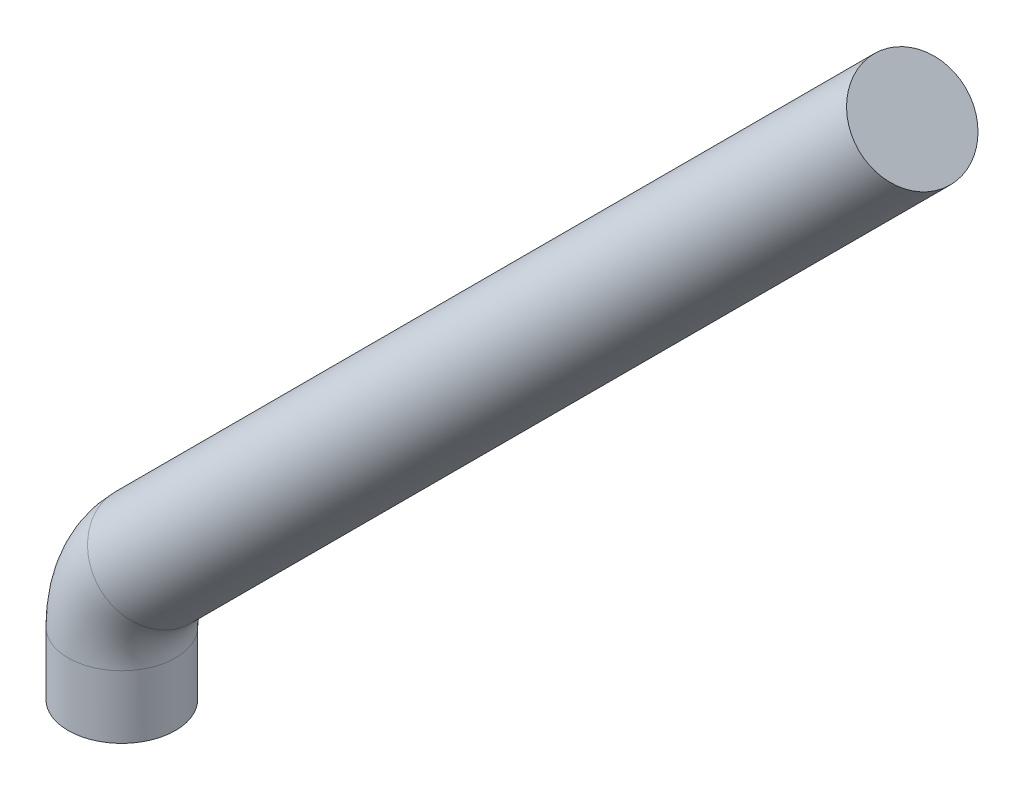
ISO-10303-21;
HEADER;
FILE_DESCRIPTION(('STEP AP214'),'2;1');
FILE_NAME('part.step','',(''),(''),'','','');
FILE_SCHEMA(('AUTOMOTIVE_DESIGN { 1 0 10303 214 1 1 1 1 }'));
ENDSEC;
DATA;
#1=APPLICATION_CONTEXT('core data for automotive mechanical design processes');
#2=APPLICATION_PROTOCOL_DEFINITION('international standard','automotive_design',2000,#1);
#3=PRODUCT_CONTEXT('',#1,'mechanical');
#4=PRODUCT('Part','Part','',(#3));
#5=PRODUCT_RELATED_PRODUCT_CATEGORY('part','',(#4));
#6=PRODUCT_DEFINITION_FORMATION('','',#4);
#7=PRODUCT_DEFINITION_CONTEXT('part definition',#1,'design');
#8=PRODUCT_DEFINITION('design','',#6,#7);
#9=PRODUCT_DEFINITION_SHAPE('','',#8);
#10=(LENGTH_UNIT() NAMED_UNIT(*) SI_UNIT(.MILLI.,.METRE.));
#11=(NAMED_UNIT(*) PLANE_ANGLE_UNIT() SI_UNIT($,.RADIAN.));
#12=(NAMED_UNIT(*) SI_UNIT($,.STERADIAN.) SOLID_ANGLE_UNIT());
#13=UNCERTAINTY_MEASURE_WITH_UNIT(LENGTH_MEASURE(1.E-05),#10,'distance_accuracy_value','');
#14=(GEOMETRIC_REPRESENTATION_CONTEXT(3) GLOBAL_UNCERTAINTY_ASSIGNED_CONTEXT((#13)) GLOBAL_UNIT_ASSIGNED_CONTEXT((#10,
#11,#12)) REPRESENTATION_CONTEXT('',''));
#15=CARTESIAN_POINT('',(0.,0.,0.));
#16=DIRECTION('',(0.,0.,1.));
#17=DIRECTION('',(1.,0.,0.));
#18=AXIS2_PLACEMENT_3D('',#15,#16,#17);
#19=CARTESIAN_POINT('',(0.,0.,0.));
#20=DIRECTION('',(0.,-1.,0.));
#21=DIRECTION('',(1.,0.,0.));
#22=AXIS2_PLACEMENT_3D('',#19,#20,#21);
#23=PLANE('',#22);
#24=CARTESIAN_POINT('',(0.,0.,0.));
#25=DIRECTION('',(0.,-1.,0.));
#26=DIRECTION('',(1.,0.,0.));
#27=AXIS2_PLACEMENT_3D('',#24,#25,#26);
#28=CIRCLE('',#27,0.127);
#29=CARTESIAN_POINT('',(0.127,0.,0.));
#30=VERTEX_POINT('',#29);
#31=EDGE_CURVE('E61',#30,#30,#28,.T.);
#32=ORIENTED_EDGE('',*,*,#31,.T.);
#33=EDGE_LOOP('',(#32));
#34=FACE_BOUND('',#33,.T.);
#35=ADVANCED_FACE('F47',(#34),#23,.T.);
#36=CARTESIAN_POINT('',(1.87044610179245,2.12444610179244,0.));
#37=DIRECTION('',(-0.707106781186549,-0.707106781186546,0.));
#38=DIRECTION('',(0.707106781186546,-0.707106781186549,0.));
#39=AXIS2_PLACEMENT_3D('',#36,#37,#38);
#40=PLANE('',#39);
#41=CARTESIAN_POINT('',(1.87044610179245,2.12444610179244,0.));
#42=DIRECTION('',(-0.707106781186549,-0.707106781186546,0.));
#43=DIRECTION('',(0.707106781186546,-0.707106781186549,0.));
#44=AXIS2_PLACEMENT_3D('',#41,#42,#43);
#45=CIRCLE('',#44,0.127);
#46=CARTESIAN_POINT('',(1.96024866300314,2.03464354058175,0.));
#47=VERTEX_POINT('',#46);
#48=EDGE_CURVE('E11',#47,#47,#45,.T.);
#49=ORIENTED_EDGE('',*,*,#48,.F.);
#50=EDGE_LOOP('',(#49));
#51=FACE_BOUND('',#50,.T.);
#52=ADVANCED_FACE('F71',(#51),#40,.F.);
#53=CARTESIAN_POINT('',(0.,0.,0.));
#54=DIRECTION('',(0.,1.,0.));
#55=DIRECTION('',(-1.,0.,0.));
#56=AXIS2_PLACEMENT_3D('',#53,#54,#55);
#57=CYLINDRICAL_SURFACE('',#56,0.127);
#58=CARTESIAN_POINT('',(0.,0.148789755157233,0.));
#59=DIRECTION('',(0.,-1.,0.));
#60=DIRECTION('',(1.,0.,0.));
#61=AXIS2_PLACEMENT_3D('',#58,#59,#60);
#62=CIRCLE('',#61,0.127);
#63=CARTESIAN_POINT('',(-0.127,0.148789755157233,0.));
#64=VERTEX_POINT('',#63);
#65=EDGE_CURVE('E57',#64,#64,#62,.T.);
#66=ORIENTED_EDGE('',*,*,#65,.T.);
#67=EDGE_LOOP('',(#66));
#68=FACE_BOUND('',#67,.T.);
#69=ORIENTED_EDGE('',*,*,#31,.F.);
#70=EDGE_LOOP('',(#69));
#71=FACE_BOUND('',#70,.T.);
#72=ADVANCED_FACE('F68',(#68,#71),#57,.T.);
#73=CARTESIAN_POINT('',(0.254,0.148789755157234,0.));
#74=DIRECTION('',(0.,0.,-1.));
#75=DIRECTION('',(-1.,0.,0.));
#76=AXIS2_PLACEMENT_3D('',#73,#74,#75);
#77=TOROIDAL_SURFACE('',#76,0.254,0.127);
#78=CARTESIAN_POINT('',(0.0743948775786185,0.328394877578616,0.));
#79=DIRECTION('',(-0.707106781186549,-0.707106781186546,0.));
#80=DIRECTION('',(0.707106781186546,-0.707106781186549,0.));
#81=AXIS2_PLACEMENT_3D('',#78,#79,#80);
#82=CIRCLE('',#81,0.127);
#83=CARTESIAN_POINT('',(-0.0154076836320743,0.418197438789309,0.));
#84=VERTEX_POINT('',#83);
#85=EDGE_CURVE('E53',#84,#84,#82,.T.);
#86=CARTESIAN_POINT('',(0.254,0.148789755157234,0.));
#87=DIRECTION('',(0.,0.,-1.));
#88=DIRECTION('',(-1.,0.,0.));
#89=AXIS2_PLACEMENT_3D('',#86,#87,#88);
#90=CIRCLE('',#89,0.381);
#91=EDGE_CURVE('',#64,#84,#90,.T.);
#92=ORIENTED_EDGE('',*,*,#65,.F.);
#93=ORIENTED_EDGE('',*,*,#85,.T.);
#94=ORIENTED_EDGE('',*,*,#91,.T.);
#95=ORIENTED_EDGE('',*,*,#91,.F.);
#96=EDGE_LOOP('',(#92,#94,#93,#95));
#97=FACE_BOUND('',#96,.T.);
#98=ADVANCED_FACE('F70',(#97),#77,.T.);
#99=CARTESIAN_POINT('',(0.0743948775786172,0.328394877578617,0.));
#100=DIRECTION('',(0.707106781186549,0.707106781186546,0.));
#101=DIRECTION('',(-0.707106781186546,0.707106781186549,0.));
#102=AXIS2_PLACEMENT_3D('',#99,#100,#101);
#103=CYLINDRICAL_SURFACE('',#102,0.127);
#104=ORIENTED_EDGE('',*,*,#48,.T.);
#105=EDGE_LOOP('',(#104));
#106=FACE_BOUND('',#105,.T.);
#107=ORIENTED_EDGE('',*,*,#85,.F.);
#108=EDGE_LOOP('',(#107));
#109=FACE_BOUND('',#108,.T.);
#110=ADVANCED_FACE('F78',(#106,#109),#103,.T.);
#111=CLOSED_SHELL('',(#35,#52,#72,#98,#110));
#112=MANIFOLD_SOLID_BREP('B2',#111);
#113=ADVANCED_BREP_SHAPE_REPRESENTATION('',(#18,#112),#14);
#114=SHAPE_DEFINITION_REPRESENTATION(#9,#113);
ENDSEC;
END-ISO-10303-21;
